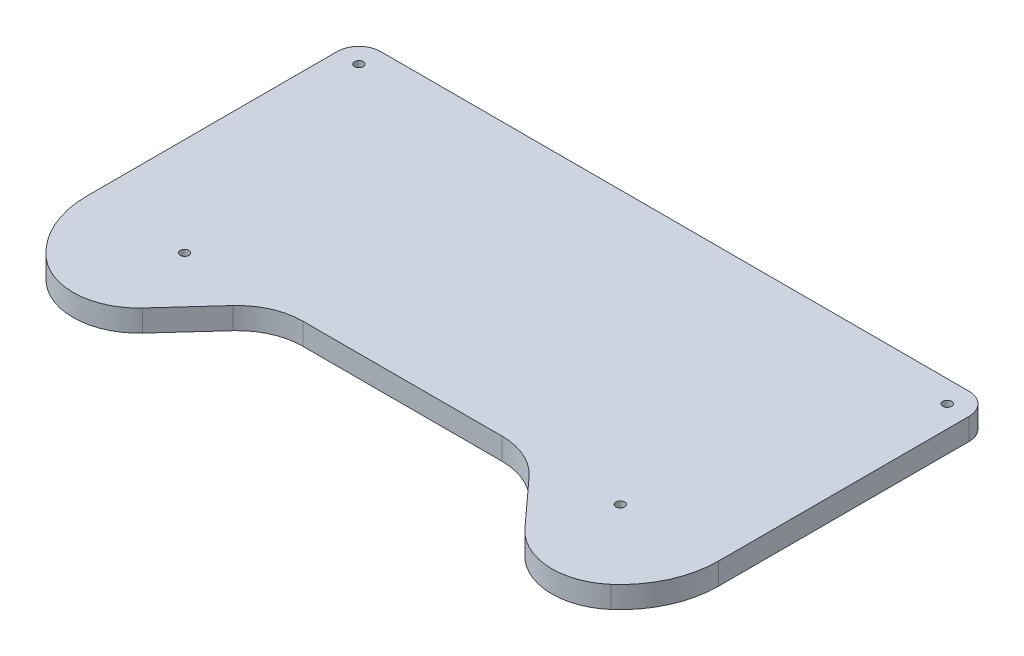
ISO-10303-21;
HEADER;
FILE_DESCRIPTION(('STEP AP214'),'2;1');
FILE_NAME('part.step','',(''),(''),'','','');
FILE_SCHEMA(('AUTOMOTIVE_DESIGN { 1 0 10303 214 1 1 1 1 }'));
ENDSEC;
DATA;
#1=APPLICATION_CONTEXT('core data for automotive mechanical design processes');
#2=APPLICATION_PROTOCOL_DEFINITION('international standard','automotive_design',2000,#1);
#3=PRODUCT_CONTEXT('',#1,'mechanical');
#4=PRODUCT('Part','Part','',(#3));
#5=PRODUCT_RELATED_PRODUCT_CATEGORY('part','',(#4));
#6=PRODUCT_DEFINITION_FORMATION('','',#4);
#7=PRODUCT_DEFINITION_CONTEXT('part definition',#1,'design');
#8=PRODUCT_DEFINITION('design','',#6,#7);
#9=PRODUCT_DEFINITION_SHAPE('','',#8);
#10=(LENGTH_UNIT() NAMED_UNIT(*) SI_UNIT(.MILLI.,.METRE.));
#11=(NAMED_UNIT(*) PLANE_ANGLE_UNIT() SI_UNIT($,.RADIAN.));
#12=(NAMED_UNIT(*) SI_UNIT($,.STERADIAN.) SOLID_ANGLE_UNIT());
#13=UNCERTAINTY_MEASURE_WITH_UNIT(LENGTH_MEASURE(1.E-05),#10,'distance_accuracy_value','');
#14=(GEOMETRIC_REPRESENTATION_CONTEXT(3) GLOBAL_UNCERTAINTY_ASSIGNED_CONTEXT((#13)) GLOBAL_UNIT_ASSIGNED_CONTEXT((#10,
#11,#12)) REPRESENTATION_CONTEXT('',''));
#15=CARTESIAN_POINT('',(0.,0.,0.));
#16=DIRECTION('',(0.,0.,1.));
#17=DIRECTION('',(1.,0.,0.));
#18=AXIS2_PLACEMENT_3D('',#15,#16,#17);
#19=CARTESIAN_POINT('',(9.9999999999999,10.,-165.));
#20=DIRECTION('',(0.,-1.,0.));
#21=DIRECTION('',(0.,0.,-1.));
#22=AXIS2_PLACEMENT_3D('',#19,#20,#21);
#23=CYLINDRICAL_SURFACE('',#22,2.00000000000001);
#24=CARTESIAN_POINT('',(9.9999999999999,10.,-165.));
#25=DIRECTION('',(0.,-1.,0.));
#26=DIRECTION('',(0.,0.,-1.));
#27=AXIS2_PLACEMENT_3D('',#24,#25,#26);
#28=CIRCLE('',#27,2.00000000000001);
#29=CARTESIAN_POINT('',(9.9999999999999,10.,-167.));
#30=VERTEX_POINT('',#29);
#31=EDGE_CURVE('E284',#30,#30,#28,.T.);
#32=ORIENTED_EDGE('',*,*,#31,.F.);
#33=EDGE_LOOP('',(#32));
#34=FACE_BOUND('',#33,.T.);
#35=CARTESIAN_POINT('',(9.9999999999999,5.,-165.));
#36=DIRECTION('',(0.,-1.,0.));
#37=DIRECTION('',(0.,0.,-1.));
#38=AXIS2_PLACEMENT_3D('',#35,#36,#37);
#39=CIRCLE('',#38,2.00000000000001);
#40=CARTESIAN_POINT('',(9.9999999999999,5.,-167.));
#41=VERTEX_POINT('',#40);
#42=EDGE_CURVE('E37',#41,#41,#39,.F.);
#43=ORIENTED_EDGE('',*,*,#42,.F.);
#44=EDGE_LOOP('',(#43));
#45=FACE_BOUND('',#44,.T.);
#46=ADVANCED_FACE('F33',(#34,#45),#23,.F.);
#47=CARTESIAN_POINT('',(280.,10.,-165.));
#48=DIRECTION('',(0.,-1.,0.));
#49=DIRECTION('',(0.,0.,-1.));
#50=AXIS2_PLACEMENT_3D('',#47,#48,#49);
#51=CYLINDRICAL_SURFACE('',#50,2.);
#52=CARTESIAN_POINT('',(280.,10.,-165.));
#53=DIRECTION('',(0.,-1.,0.));
#54=DIRECTION('',(0.,0.,-1.));
#55=AXIS2_PLACEMENT_3D('',#52,#53,#54);
#56=CIRCLE('',#55,2.);
#57=CARTESIAN_POINT('',(280.,10.,-167.));
#58=VERTEX_POINT('',#57);
#59=EDGE_CURVE('E276',#58,#58,#56,.T.);
#60=ORIENTED_EDGE('',*,*,#59,.F.);
#61=EDGE_LOOP('',(#60));
#62=FACE_BOUND('',#61,.T.);
#63=CARTESIAN_POINT('',(280.,5.,-165.));
#64=DIRECTION('',(0.,-1.,0.));
#65=DIRECTION('',(0.,0.,-1.));
#66=AXIS2_PLACEMENT_3D('',#63,#64,#65);
#67=CIRCLE('',#66,2.);
#68=CARTESIAN_POINT('',(280.,5.,-167.));
#69=VERTEX_POINT('',#68);
#70=EDGE_CURVE('E214',#69,#69,#67,.F.);
#71=ORIENTED_EDGE('',*,*,#70,.F.);
#72=EDGE_LOOP('',(#71));
#73=FACE_BOUND('',#72,.T.);
#74=ADVANCED_FACE('F322',(#62,#73),#51,.F.);
#75=CARTESIAN_POINT('',(245.,0.,-50.));
#76=DIRECTION('',(0.,1.,0.));
#77=DIRECTION('',(0.,0.,1.));
#78=AXIS2_PLACEMENT_3D('',#75,#76,#77);
#79=CYLINDRICAL_SURFACE('',#78,2.00000000000002);
#80=CARTESIAN_POINT('',(245.,10.,-50.));
#81=DIRECTION('',(0.,1.,0.));
#82=DIRECTION('',(0.,0.,-1.));
#83=AXIS2_PLACEMENT_3D('',#80,#81,#82);
#84=CIRCLE('',#83,2.00000000000002);
#85=CARTESIAN_POINT('',(245.,10.,-52.));
#86=VERTEX_POINT('',#85);
#87=EDGE_CURVE('E166',#86,#86,#84,.T.);
#88=ORIENTED_EDGE('',*,*,#87,.T.);
#89=EDGE_LOOP('',(#88));
#90=FACE_BOUND('',#89,.T.);
#91=CARTESIAN_POINT('',(245.,5.,-50.));
#92=DIRECTION('',(0.,-1.,0.));
#93=DIRECTION('',(0.,0.,-1.));
#94=AXIS2_PLACEMENT_3D('',#91,#92,#93);
#95=CIRCLE('',#94,2.00000000000002);
#96=CARTESIAN_POINT('',(245.,5.,-52.));
#97=VERTEX_POINT('',#96);
#98=EDGE_CURVE('E210',#97,#97,#95,.F.);
#99=ORIENTED_EDGE('',*,*,#98,.F.);
#100=EDGE_LOOP('',(#99));
#101=FACE_BOUND('',#100,.T.);
#102=ADVANCED_FACE('F328',(#90,#101),#79,.F.);
#103=CARTESIAN_POINT('',(45.,0.,-50.));
#104=DIRECTION('',(0.,1.,0.));
#105=DIRECTION('',(0.,0.,1.));
#106=AXIS2_PLACEMENT_3D('',#103,#104,#105);
#107=CYLINDRICAL_SURFACE('',#106,2.);
#108=CARTESIAN_POINT('',(45.,10.,-50.));
#109=DIRECTION('',(0.,1.,0.));
#110=DIRECTION('',(0.,0.,1.));
#111=AXIS2_PLACEMENT_3D('',#108,#109,#110);
#112=CIRCLE('',#111,2.);
#113=CARTESIAN_POINT('',(45.,10.,-48.));
#114=VERTEX_POINT('',#113);
#115=EDGE_CURVE('E161',#114,#114,#112,.T.);
#116=ORIENTED_EDGE('',*,*,#115,.T.);
#117=EDGE_LOOP('',(#116));
#118=FACE_BOUND('',#117,.T.);
#119=CARTESIAN_POINT('',(45.,5.,-50.));
#120=DIRECTION('',(0.,-1.,0.));
#121=DIRECTION('',(0.,0.,-1.));
#122=AXIS2_PLACEMENT_3D('',#119,#120,#121);
#123=CIRCLE('',#122,2.);
#124=CARTESIAN_POINT('',(45.,5.,-52.));
#125=VERTEX_POINT('',#124);
#126=EDGE_CURVE('E205',#125,#125,#123,.F.);
#127=ORIENTED_EDGE('',*,*,#126,.F.);
#128=EDGE_LOOP('',(#127));
#129=FACE_BOUND('',#128,.T.);
#130=ADVANCED_FACE('F336',(#118,#129),#107,.F.);
#131=CARTESIAN_POINT('',(0.,10.,0.));
#132=DIRECTION('',(0.,-1.,0.));
#133=DIRECTION('',(0.,0.,-1.));
#134=AXIS2_PLACEMENT_3D('',#131,#132,#133);
#135=PLANE('',#134);
#136=ORIENTED_EDGE('',*,*,#59,.T.);
#137=EDGE_LOOP('',(#136));
#138=FACE_BOUND('',#137,.T.);
#139=ORIENTED_EDGE('',*,*,#31,.T.);
#140=EDGE_LOOP('',(#139));
#141=FACE_BOUND('',#140,.T.);
#142=ORIENTED_EDGE('',*,*,#87,.F.);
#143=EDGE_LOOP('',(#142));
#144=FACE_BOUND('',#143,.T.);
#145=ORIENTED_EDGE('',*,*,#115,.F.);
#146=EDGE_LOOP('',(#145));
#147=FACE_BOUND('',#146,.T.);
#148=DIRECTION('',(-0.673718097085599,0.,-0.738988447581801));
#149=VECTOR('',#148,1.);
#150=CARTESIAN_POINT('',(245.,10.,-5.00000000000004));
#151=LINE('',#150,#149);
#152=CARTESIAN_POINT('',(232.699364936198,10.,-18.4923304708477));
#153=VERTEX_POINT('',#152);
#154=CARTESIAN_POINT('',(212.89847829945,10.,-40.211542912568));
#155=VERTEX_POINT('',#154);
#156=EDGE_CURVE('E208',#153,#155,#151,.T.);
#157=ORIENTED_EDGE('',*,*,#156,.F.);
#158=CARTESIAN_POINT('',(254.869018363652,10.,-38.7038733834157));
#159=DIRECTION('',(0.,-1.,0.));
#160=DIRECTION('',(0.,0.,-1.));
#161=AXIS2_PLACEMENT_3D('',#158,#159,#160);
#162=CIRCLE('',#161,30.);
#163=CARTESIAN_POINT('',(274.607055090955,10.,-16.111620150247));
#164=VERTEX_POINT('',#163);
#165=EDGE_CURVE('E197',#153,#164,#162,.F.);
#166=ORIENTED_EDGE('',*,*,#165,.T.);
#167=CARTESIAN_POINT('',(245.,10.,-50.));
#168=DIRECTION('',(0.,1.,0.));
#169=DIRECTION('',(0.,0.,1.));
#170=AXIS2_PLACEMENT_3D('',#167,#168,#169);
#171=CIRCLE('',#170,45.);
#172=CARTESIAN_POINT('',(290.,10.,-50.));
#173=VERTEX_POINT('',#172);
#174=EDGE_CURVE('E155',#164,#173,#171,.T.);
#175=ORIENTED_EDGE('',*,*,#174,.T.);
#176=DIRECTION('',(0.,0.,-1.));
#177=VECTOR('',#176,1.);
#178=CARTESIAN_POINT('',(290.,10.,0.));
#179=LINE('',#178,#177);
#180=CARTESIAN_POINT('',(290.,10.,-165.));
#181=VERTEX_POINT('',#180);
#182=EDGE_CURVE('E169',#173,#181,#179,.T.);
#183=ORIENTED_EDGE('',*,*,#182,.T.);
#184=CARTESIAN_POINT('',(280.,10.,-165.));
#185=DIRECTION('',(0.,1.,0.));
#186=DIRECTION('',(0.,0.,1.));
#187=AXIS2_PLACEMENT_3D('',#184,#185,#186);
#188=CIRCLE('',#187,9.99999999999991);
#189=CARTESIAN_POINT('',(280.,10.,-175.));
#190=VERTEX_POINT('',#189);
#191=EDGE_CURVE('E256',#181,#190,#188,.T.);
#192=ORIENTED_EDGE('',*,*,#191,.T.);
#193=DIRECTION('',(1.,0.,0.));
#194=VECTOR('',#193,1.);
#195=CARTESIAN_POINT('',(0.,10.,-175.));
#196=LINE('',#195,#194);
#197=CARTESIAN_POINT('',(9.9999999999999,10.,-175.));
#198=VERTEX_POINT('',#197);
#199=EDGE_CURVE('E261',#198,#190,#196,.T.);
#200=ORIENTED_EDGE('',*,*,#199,.F.);
#201=CARTESIAN_POINT('',(9.9999999999999,10.,-165.));
#202=DIRECTION('',(0.,1.,0.));
#203=DIRECTION('',(0.,0.,1.));
#204=AXIS2_PLACEMENT_3D('',#201,#202,#203);
#205=CIRCLE('',#204,9.9999999999999);
#206=CARTESIAN_POINT('',(0.,10.,-165.));
#207=VERTEX_POINT('',#206);
#208=EDGE_CURVE('E269',#198,#207,#205,.T.);
#209=ORIENTED_EDGE('',*,*,#208,.T.);
#210=DIRECTION('',(0.,0.,1.));
#211=VECTOR('',#210,1.);
#212=CARTESIAN_POINT('',(0.,10.,0.));
#213=LINE('',#212,#211);
#214=CARTESIAN_POINT('',(0.,10.,-50.));
#215=VERTEX_POINT('',#214);
#216=EDGE_CURVE('E163',#207,#215,#213,.T.);
#217=ORIENTED_EDGE('',*,*,#216,.T.);
#218=CARTESIAN_POINT('',(45.,10.,-50.));
#219=DIRECTION('',(0.,1.,0.));
#220=DIRECTION('',(0.,0.,1.));
#221=AXIS2_PLACEMENT_3D('',#218,#219,#220);
#222=CIRCLE('',#221,45.);
#223=CARTESIAN_POINT('',(15.3929449090449,10.,-16.1116201502469));
#224=VERTEX_POINT('',#223);
#225=EDGE_CURVE('E142',#215,#224,#222,.T.);
#226=ORIENTED_EDGE('',*,*,#225,.T.);
#227=CARTESIAN_POINT('',(35.1309816363483,10.,-38.7038733834156));
#228=DIRECTION('',(0.,-1.,0.));
#229=DIRECTION('',(0.,0.,-1.));
#230=AXIS2_PLACEMENT_3D('',#227,#228,#229);
#231=CIRCLE('',#230,30.);
#232=CARTESIAN_POINT('',(57.3006350638023,10.,-18.4923304708477));
#233=VERTEX_POINT('',#232);
#234=EDGE_CURVE('E195',#224,#233,#231,.F.);
#235=ORIENTED_EDGE('',*,*,#234,.T.);
#236=DIRECTION('',(-0.673718097085598,0.,0.738988447581801));
#237=VECTOR('',#236,1.);
#238=CARTESIAN_POINT('',(86.0254239671264,10.,-50.));
#239=LINE('',#238,#237);
#240=CARTESIAN_POINT('',(77.1015217005503,10.,-40.211542912568));
#241=VERTEX_POINT('',#240);
#242=EDGE_CURVE('E242',#241,#233,#239,.T.);
#243=ORIENTED_EDGE('',*,*,#242,.F.);
#244=CARTESIAN_POINT('',(99.2711751280043,10.,-20.));
#245=DIRECTION('',(0.,-1.,0.));
#246=DIRECTION('',(0.,0.,-1.));
#247=AXIS2_PLACEMENT_3D('',#244,#245,#246);
#248=CIRCLE('',#247,30.);
#249=CARTESIAN_POINT('',(99.2711751280043,10.,-50.));
#250=VERTEX_POINT('',#249);
#251=EDGE_CURVE('E188',#241,#250,#248,.T.);
#252=ORIENTED_EDGE('',*,*,#251,.T.);
#253=DIRECTION('',(-1.,0.,0.));
#254=VECTOR('',#253,1.);
#255=CARTESIAN_POINT('',(203.974576032874,10.,-50.));
#256=LINE('',#255,#254);
#257=CARTESIAN_POINT('',(190.728824871996,10.,-50.));
#258=VERTEX_POINT('',#257);
#259=EDGE_CURVE('E248',#258,#250,#256,.T.);
#260=ORIENTED_EDGE('',*,*,#259,.F.);
#261=CARTESIAN_POINT('',(190.728824871996,10.,-20.));
#262=DIRECTION('',(0.,-1.,0.));
#263=DIRECTION('',(0.,0.,-1.));
#264=AXIS2_PLACEMENT_3D('',#261,#262,#263);
#265=CIRCLE('',#264,30.);
#266=EDGE_CURVE('E183',#258,#155,#265,.T.);
#267=ORIENTED_EDGE('',*,*,#266,.T.);
#268=EDGE_LOOP('',(#157,#166,#175,#183,#192,#200,#209,#217,#226,#235,#243,#252,#260,#267));
#269=FACE_BOUND('',#268,.T.);
#270=ADVANCED_FACE('F292',(#138,#141,#144,#147,#269),#135,.F.);
#271=CARTESIAN_POINT('',(0.,0.,0.));
#272=DIRECTION('',(0.,-1.,0.));
#273=DIRECTION('',(0.,0.,-1.));
#274=AXIS2_PLACEMENT_3D('',#271,#272,#273);
#275=PLANE('',#274);
#276=CARTESIAN_POINT('',(9.9999999999999,0.,-165.));
#277=DIRECTION('',(0.,-1.,0.));
#278=DIRECTION('',(0.,0.,-1.));
#279=AXIS2_PLACEMENT_3D('',#276,#277,#278);
#280=CIRCLE('',#279,6.);
#281=CARTESIAN_POINT('',(9.9999999999999,0.,-171.));
#282=VERTEX_POINT('',#281);
#283=EDGE_CURVE('E230',#282,#282,#280,.T.);
#284=ORIENTED_EDGE('',*,*,#283,.F.);
#285=EDGE_LOOP('',(#284));
#286=FACE_BOUND('',#285,.T.);
#287=CARTESIAN_POINT('',(280.,0.,-165.));
#288=DIRECTION('',(0.,-1.,0.));
#289=DIRECTION('',(0.,0.,-1.));
#290=AXIS2_PLACEMENT_3D('',#287,#288,#289);
#291=CIRCLE('',#290,5.99999999999999);
#292=CARTESIAN_POINT('',(280.,0.,-171.));
#293=VERTEX_POINT('',#292);
#294=EDGE_CURVE('E223',#293,#293,#291,.T.);
#295=ORIENTED_EDGE('',*,*,#294,.F.);
#296=EDGE_LOOP('',(#295));
#297=FACE_BOUND('',#296,.T.);
#298=CARTESIAN_POINT('',(245.,0.,-50.));
#299=DIRECTION('',(0.,-1.,0.));
#300=DIRECTION('',(0.,0.,-1.));
#301=AXIS2_PLACEMENT_3D('',#298,#299,#300);
#302=CIRCLE('',#301,5.99999999999999);
#303=CARTESIAN_POINT('',(245.,0.,-56.));
#304=VERTEX_POINT('',#303);
#305=EDGE_CURVE('E216',#304,#304,#302,.T.);
#306=ORIENTED_EDGE('',*,*,#305,.F.);
#307=EDGE_LOOP('',(#306));
#308=FACE_BOUND('',#307,.T.);
#309=CARTESIAN_POINT('',(45.,0.,-50.));
#310=DIRECTION('',(0.,-1.,0.));
#311=DIRECTION('',(0.,0.,-1.));
#312=AXIS2_PLACEMENT_3D('',#309,#310,#311);
#313=CIRCLE('',#312,6.);
#314=CARTESIAN_POINT('',(45.,0.,-56.));
#315=VERTEX_POINT('',#314);
#316=EDGE_CURVE('E212',#315,#315,#313,.T.);
#317=ORIENTED_EDGE('',*,*,#316,.F.);
#318=EDGE_LOOP('',(#317));
#319=FACE_BOUND('',#318,.T.);
#320=CARTESIAN_POINT('',(245.,0.,-50.));
#321=DIRECTION('',(0.,1.,0.));
#322=DIRECTION('',(0.,0.,1.));
#323=AXIS2_PLACEMENT_3D('',#320,#321,#322);
#324=CIRCLE('',#323,45.);
#325=CARTESIAN_POINT('',(274.607055090955,0.,-16.111620150247));
#326=VERTEX_POINT('',#325);
#327=CARTESIAN_POINT('',(290.,0.,-50.));
#328=VERTEX_POINT('',#327);
#329=EDGE_CURVE('E148',#326,#328,#324,.T.);
#330=ORIENTED_EDGE('',*,*,#329,.F.);
#331=CARTESIAN_POINT('',(254.869018363652,0.,-38.7038733834157));
#332=DIRECTION('',(0.,-1.,0.));
#333=DIRECTION('',(0.,0.,-1.));
#334=AXIS2_PLACEMENT_3D('',#331,#332,#333);
#335=CIRCLE('',#334,30.);
#336=CARTESIAN_POINT('',(232.699364936198,0.,-18.4923304708477));
#337=VERTEX_POINT('',#336);
#338=EDGE_CURVE('E202',#326,#337,#335,.T.);
#339=ORIENTED_EDGE('',*,*,#338,.T.);
#340=DIRECTION('',(-0.673718097085599,0.,-0.738988447581801));
#341=VECTOR('',#340,1.);
#342=CARTESIAN_POINT('',(245.,0.,-5.00000000000004));
#343=LINE('',#342,#341);
#344=CARTESIAN_POINT('',(212.89847829945,0.,-40.211542912568));
#345=VERTEX_POINT('',#344);
#346=EDGE_CURVE('E239',#337,#345,#343,.T.);
#347=ORIENTED_EDGE('',*,*,#346,.T.);
#348=CARTESIAN_POINT('',(190.728824871996,0.,-20.));
#349=DIRECTION('',(0.,-1.,0.));
#350=DIRECTION('',(0.,0.,-1.));
#351=AXIS2_PLACEMENT_3D('',#348,#349,#350);
#352=CIRCLE('',#351,30.);
#353=CARTESIAN_POINT('',(190.728824871996,0.,-50.));
#354=VERTEX_POINT('',#353);
#355=EDGE_CURVE('E186',#345,#354,#352,.F.);
#356=ORIENTED_EDGE('',*,*,#355,.T.);
#357=DIRECTION('',(-1.,0.,0.));
#358=VECTOR('',#357,1.);
#359=CARTESIAN_POINT('',(203.974576032874,0.,-50.));
#360=LINE('',#359,#358);
#361=CARTESIAN_POINT('',(99.2711751280043,0.,-50.));
#362=VERTEX_POINT('',#361);
#363=EDGE_CURVE('E241',#354,#362,#360,.T.);
#364=ORIENTED_EDGE('',*,*,#363,.T.);
#365=CARTESIAN_POINT('',(99.2711751280043,0.,-20.));
#366=DIRECTION('',(0.,-1.,0.));
#367=DIRECTION('',(0.,0.,-1.));
#368=AXIS2_PLACEMENT_3D('',#365,#366,#367);
#369=CIRCLE('',#368,30.);
#370=CARTESIAN_POINT('',(77.1015217005503,0.,-40.211542912568));
#371=VERTEX_POINT('',#370);
#372=EDGE_CURVE('E190',#362,#371,#369,.F.);
#373=ORIENTED_EDGE('',*,*,#372,.T.);
#374=DIRECTION('',(-0.673718097085598,0.,0.738988447581801));
#375=VECTOR('',#374,1.);
#376=CARTESIAN_POINT('',(86.0254239671264,0.,-50.));
#377=LINE('',#376,#375);
#378=CARTESIAN_POINT('',(57.3006350638023,0.,-18.4923304708477));
#379=VERTEX_POINT('',#378);
#380=EDGE_CURVE('E245',#371,#379,#377,.T.);
#381=ORIENTED_EDGE('',*,*,#380,.T.);
#382=CARTESIAN_POINT('',(35.1309816363483,0.,-38.7038733834156));
#383=DIRECTION('',(0.,-1.,0.));
#384=DIRECTION('',(0.,0.,-1.));
#385=AXIS2_PLACEMENT_3D('',#382,#383,#384);
#386=CIRCLE('',#385,30.);
#387=CARTESIAN_POINT('',(15.3929449090449,0.,-16.1116201502469));
#388=VERTEX_POINT('',#387);
#389=EDGE_CURVE('E50',#379,#388,#386,.T.);
#390=ORIENTED_EDGE('',*,*,#389,.T.);
#391=CARTESIAN_POINT('',(45.,0.,-50.));
#392=DIRECTION('',(0.,1.,0.));
#393=DIRECTION('',(0.,0.,1.));
#394=AXIS2_PLACEMENT_3D('',#391,#392,#393);
#395=CIRCLE('',#394,45.);
#396=CARTESIAN_POINT('',(0.,0.,-50.));
#397=VERTEX_POINT('',#396);
#398=EDGE_CURVE('E139',#397,#388,#395,.T.);
#399=ORIENTED_EDGE('',*,*,#398,.F.);
#400=DIRECTION('',(0.,0.,1.));
#401=VECTOR('',#400,1.);
#402=CARTESIAN_POINT('',(0.,0.,0.));
#403=LINE('',#402,#401);
#404=CARTESIAN_POINT('',(0.,0.,-165.));
#405=VERTEX_POINT('',#404);
#406=EDGE_CURVE('E154',#405,#397,#403,.T.);
#407=ORIENTED_EDGE('',*,*,#406,.F.);
#408=CARTESIAN_POINT('',(9.9999999999999,0.,-165.));
#409=DIRECTION('',(0.,1.,0.));
#410=DIRECTION('',(0.,0.,1.));
#411=AXIS2_PLACEMENT_3D('',#408,#409,#410);
#412=CIRCLE('',#411,9.9999999999999);
#413=CARTESIAN_POINT('',(9.9999999999999,0.,-175.));
#414=VERTEX_POINT('',#413);
#415=EDGE_CURVE('E260',#414,#405,#412,.T.);
#416=ORIENTED_EDGE('',*,*,#415,.F.);
#417=DIRECTION('',(1.,0.,0.));
#418=VECTOR('',#417,1.);
#419=CARTESIAN_POINT('',(0.,0.,-175.));
#420=LINE('',#419,#418);
#421=CARTESIAN_POINT('',(280.,0.,-175.));
#422=VERTEX_POINT('',#421);
#423=EDGE_CURVE('E263',#414,#422,#420,.T.);
#424=ORIENTED_EDGE('',*,*,#423,.T.);
#425=CARTESIAN_POINT('',(280.,0.,-165.));
#426=DIRECTION('',(0.,1.,0.));
#427=DIRECTION('',(0.,0.,1.));
#428=AXIS2_PLACEMENT_3D('',#425,#426,#427);
#429=CIRCLE('',#428,9.99999999999991);
#430=CARTESIAN_POINT('',(290.,0.,-165.));
#431=VERTEX_POINT('',#430);
#432=EDGE_CURVE('E258',#431,#422,#429,.T.);
#433=ORIENTED_EDGE('',*,*,#432,.F.);
#434=DIRECTION('',(0.,0.,-1.));
#435=VECTOR('',#434,1.);
#436=CARTESIAN_POINT('',(290.,0.,0.));
#437=LINE('',#436,#435);
#438=EDGE_CURVE('E160',#328,#431,#437,.T.);
#439=ORIENTED_EDGE('',*,*,#438,.F.);
#440=EDGE_LOOP('',(#330,#339,#347,#356,#364,#373,#381,#390,#399,#407,#416,#424,#433,#439));
#441=FACE_BOUND('',#440,.T.);
#442=ADVANCED_FACE('F152',(#286,#297,#308,#319,#441),#275,.T.);
#443=CARTESIAN_POINT('',(290.,10.,0.));
#444=DIRECTION('',(-1.,0.,0.));
#445=DIRECTION('',(0.,0.,1.));
#446=AXIS2_PLACEMENT_3D('',#443,#444,#445);
#447=PLANE('',#446);
#448=DIRECTION('',(0.,1.,0.));
#449=VECTOR('',#448,1.);
#450=CARTESIAN_POINT('',(290.,0.,-50.));
#451=LINE('',#450,#449);
#452=EDGE_CURVE('E147',#328,#173,#451,.T.);
#453=ORIENTED_EDGE('',*,*,#452,.F.);
#454=ORIENTED_EDGE('',*,*,#438,.T.);
#455=DIRECTION('',(0.,1.,0.));
#456=VECTOR('',#455,1.);
#457=CARTESIAN_POINT('',(290.,0.,-165.));
#458=LINE('',#457,#456);
#459=EDGE_CURVE('E266',#431,#181,#458,.T.);
#460=ORIENTED_EDGE('',*,*,#459,.T.);
#461=ORIENTED_EDGE('',*,*,#182,.F.);
#462=EDGE_LOOP('',(#453,#454,#460,#461));
#463=FACE_BOUND('',#462,.T.);
#464=ADVANCED_FACE('F302',(#463),#447,.F.);
#465=CARTESIAN_POINT('',(0.,10.,0.));
#466=DIRECTION('',(1.,0.,0.));
#467=DIRECTION('',(0.,0.,-1.));
#468=AXIS2_PLACEMENT_3D('',#465,#466,#467);
#469=PLANE('',#468);
#470=ORIENTED_EDGE('',*,*,#406,.T.);
#471=DIRECTION('',(0.,1.,0.));
#472=VECTOR('',#471,1.);
#473=CARTESIAN_POINT('',(0.,0.,-50.));
#474=LINE('',#473,#472);
#475=EDGE_CURVE('E136',#397,#215,#474,.T.);
#476=ORIENTED_EDGE('',*,*,#475,.T.);
#477=ORIENTED_EDGE('',*,*,#216,.F.);
#478=DIRECTION('',(0.,1.,0.));
#479=VECTOR('',#478,1.);
#480=CARTESIAN_POINT('',(0.,0.,-165.));
#481=LINE('',#480,#479);
#482=EDGE_CURVE('E159',#405,#207,#481,.T.);
#483=ORIENTED_EDGE('',*,*,#482,.F.);
#484=EDGE_LOOP('',(#470,#476,#477,#483));
#485=FACE_BOUND('',#484,.T.);
#486=ADVANCED_FACE('F158',(#485),#469,.F.);
#487=CARTESIAN_POINT('',(280.,0.,-165.));
#488=DIRECTION('',(0.,1.,0.));
#489=DIRECTION('',(0.,0.,1.));
#490=AXIS2_PLACEMENT_3D('',#487,#488,#489);
#491=CYLINDRICAL_SURFACE('',#490,9.99999999999991);
#492=ORIENTED_EDGE('',*,*,#191,.F.);
#493=ORIENTED_EDGE('',*,*,#459,.F.);
#494=ORIENTED_EDGE('',*,*,#432,.T.);
#495=DIRECTION('',(0.,1.,0.));
#496=VECTOR('',#495,1.);
#497=CARTESIAN_POINT('',(280.,0.,-175.));
#498=LINE('',#497,#496);
#499=EDGE_CURVE('E274',#422,#190,#498,.T.);
#500=ORIENTED_EDGE('',*,*,#499,.T.);
#501=EDGE_LOOP('',(#492,#493,#494,#500));
#502=FACE_BOUND('',#501,.T.);
#503=ADVANCED_FACE('F299',(#502),#491,.T.);
#504=CARTESIAN_POINT('',(0.,0.,-175.));
#505=DIRECTION('',(0.,0.,1.));
#506=DIRECTION('',(1.,0.,0.));
#507=AXIS2_PLACEMENT_3D('',#504,#505,#506);
#508=PLANE('',#507);
#509=ORIENTED_EDGE('',*,*,#199,.T.);
#510=ORIENTED_EDGE('',*,*,#499,.F.);
#511=ORIENTED_EDGE('',*,*,#423,.F.);
#512=DIRECTION('',(0.,1.,0.));
#513=VECTOR('',#512,1.);
#514=CARTESIAN_POINT('',(9.9999999999999,0.,-175.));
#515=LINE('',#514,#513);
#516=EDGE_CURVE('E277',#414,#198,#515,.T.);
#517=ORIENTED_EDGE('',*,*,#516,.T.);
#518=EDGE_LOOP('',(#509,#510,#511,#517));
#519=FACE_BOUND('',#518,.T.);
#520=ADVANCED_FACE('F306',(#519),#508,.F.);
#521=CARTESIAN_POINT('',(9.9999999999999,0.,-165.));
#522=DIRECTION('',(0.,1.,0.));
#523=DIRECTION('',(0.,0.,1.));
#524=AXIS2_PLACEMENT_3D('',#521,#522,#523);
#525=CYLINDRICAL_SURFACE('',#524,9.9999999999999);
#526=ORIENTED_EDGE('',*,*,#208,.F.);
#527=ORIENTED_EDGE('',*,*,#516,.F.);
#528=ORIENTED_EDGE('',*,*,#415,.T.);
#529=ORIENTED_EDGE('',*,*,#482,.T.);
#530=EDGE_LOOP('',(#526,#527,#528,#529));
#531=FACE_BOUND('',#530,.T.);
#532=ADVANCED_FACE('F310',(#531),#525,.T.);
#533=CARTESIAN_POINT('',(45.,0.,-50.));
#534=DIRECTION('',(0.,1.,0.));
#535=DIRECTION('',(0.,0.,1.));
#536=AXIS2_PLACEMENT_3D('',#533,#534,#535);
#537=CYLINDRICAL_SURFACE('',#536,45.);
#538=ORIENTED_EDGE('',*,*,#398,.T.);
#539=DIRECTION('',(0.,1.,0.));
#540=VECTOR('',#539,1.);
#541=CARTESIAN_POINT('',(15.3929449090449,0.,-16.1116201502469));
#542=LINE('',#541,#540);
#543=EDGE_CURVE('E42',#388,#224,#542,.T.);
#544=ORIENTED_EDGE('',*,*,#543,.T.);
#545=ORIENTED_EDGE('',*,*,#225,.F.);
#546=ORIENTED_EDGE('',*,*,#475,.F.);
#547=EDGE_LOOP('',(#538,#544,#545,#546));
#548=FACE_BOUND('',#547,.T.);
#549=ADVANCED_FACE('F137',(#548),#537,.T.);
#550=CARTESIAN_POINT('',(245.,0.,-50.));
#551=DIRECTION('',(0.,1.,0.));
#552=DIRECTION('',(0.,0.,1.));
#553=AXIS2_PLACEMENT_3D('',#550,#551,#552);
#554=CYLINDRICAL_SURFACE('',#553,45.);
#555=ORIENTED_EDGE('',*,*,#174,.F.);
#556=DIRECTION('',(0.,1.,0.));
#557=VECTOR('',#556,1.);
#558=CARTESIAN_POINT('',(274.607055090955,0.,-16.1116201502471));
#559=LINE('',#558,#557);
#560=EDGE_CURVE('E199',#164,#326,#559,.F.);
#561=ORIENTED_EDGE('',*,*,#560,.T.);
#562=ORIENTED_EDGE('',*,*,#329,.T.);
#563=ORIENTED_EDGE('',*,*,#452,.T.);
#564=EDGE_LOOP('',(#555,#561,#562,#563));
#565=FACE_BOUND('',#564,.T.);
#566=ADVANCED_FACE('F317',(#565),#554,.T.);
#567=CARTESIAN_POINT('',(86.0254239671264,0.,-50.));
#568=DIRECTION('',(-0.738988447581801,0.,-0.673718097085598));
#569=DIRECTION('',(-0.673718097085598,0.,0.738988447581801));
#570=AXIS2_PLACEMENT_3D('',#567,#568,#569);
#571=PLANE('',#570);
#572=ORIENTED_EDGE('',*,*,#242,.T.);
#573=DIRECTION('',(0.,-1.,0.));
#574=VECTOR('',#573,1.);
#575=CARTESIAN_POINT('',(57.3006350638023,0.,-18.4923304708477));
#576=LINE('',#575,#574);
#577=EDGE_CURVE('E11',#233,#379,#576,.T.);
#578=ORIENTED_EDGE('',*,*,#577,.T.);
#579=ORIENTED_EDGE('',*,*,#380,.F.);
#580=DIRECTION('',(0.,1.,0.));
#581=VECTOR('',#580,1.);
#582=CARTESIAN_POINT('',(77.1015217005503,10.,-40.211542912568));
#583=LINE('',#582,#581);
#584=EDGE_CURVE('E180',#371,#241,#583,.T.);
#585=ORIENTED_EDGE('',*,*,#584,.T.);
#586=EDGE_LOOP('',(#572,#578,#579,#585));
#587=FACE_BOUND('',#586,.T.);
#588=ADVANCED_FACE('F381',(#587),#571,.F.);
#589=CARTESIAN_POINT('',(203.974576032874,0.,-50.));
#590=DIRECTION('',(0.,0.,-1.));
#591=DIRECTION('',(-1.,0.,0.));
#592=AXIS2_PLACEMENT_3D('',#589,#590,#591);
#593=PLANE('',#592);
#594=ORIENTED_EDGE('',*,*,#363,.F.);
#595=DIRECTION('',(0.,1.,0.));
#596=VECTOR('',#595,1.);
#597=CARTESIAN_POINT('',(190.728824871996,10.,-50.));
#598=LINE('',#597,#596);
#599=EDGE_CURVE('E174',#354,#258,#598,.T.);
#600=ORIENTED_EDGE('',*,*,#599,.T.);
#601=ORIENTED_EDGE('',*,*,#259,.T.);
#602=DIRECTION('',(0.,1.,0.));
#603=VECTOR('',#602,1.);
#604=CARTESIAN_POINT('',(99.2711751280043,0.,-50.));
#605=LINE('',#604,#603);
#606=EDGE_CURVE('E172',#250,#362,#605,.F.);
#607=ORIENTED_EDGE('',*,*,#606,.T.);
#608=EDGE_LOOP('',(#594,#600,#601,#607));
#609=FACE_BOUND('',#608,.T.);
#610=ADVANCED_FACE('F377',(#609),#593,.F.);
#611=CARTESIAN_POINT('',(245.,0.,-5.00000000000004));
#612=DIRECTION('',(0.738988447581801,0.,-0.673718097085599));
#613=DIRECTION('',(-0.673718097085599,0.,-0.738988447581801));
#614=AXIS2_PLACEMENT_3D('',#611,#612,#613);
#615=PLANE('',#614);
#616=ORIENTED_EDGE('',*,*,#346,.F.);
#617=DIRECTION('',(0.,-1.,0.));
#618=VECTOR('',#617,1.);
#619=CARTESIAN_POINT('',(232.699364936198,10.,-18.4923304708477));
#620=LINE('',#619,#618);
#621=EDGE_CURVE('E192',#337,#153,#620,.F.);
#622=ORIENTED_EDGE('',*,*,#621,.T.);
#623=ORIENTED_EDGE('',*,*,#156,.T.);
#624=DIRECTION('',(0.,1.,0.));
#625=VECTOR('',#624,1.);
#626=CARTESIAN_POINT('',(212.89847829945,0.,-40.211542912568));
#627=LINE('',#626,#625);
#628=EDGE_CURVE('E177',#155,#345,#627,.F.);
#629=ORIENTED_EDGE('',*,*,#628,.T.);
#630=EDGE_LOOP('',(#616,#622,#623,#629));
#631=FACE_BOUND('',#630,.T.);
#632=ADVANCED_FACE('F355',(#631),#615,.F.);
#633=CARTESIAN_POINT('',(190.728824871996,0.,-20.));
#634=DIRECTION('',(0.,-1.,0.));
#635=DIRECTION('',(0.,0.,-1.));
#636=AXIS2_PLACEMENT_3D('',#633,#634,#635);
#637=CYLINDRICAL_SURFACE('',#636,30.);
#638=ORIENTED_EDGE('',*,*,#355,.F.);
#639=ORIENTED_EDGE('',*,*,#628,.F.);
#640=ORIENTED_EDGE('',*,*,#266,.F.);
#641=ORIENTED_EDGE('',*,*,#599,.F.);
#642=EDGE_LOOP('',(#638,#639,#640,#641));
#643=FACE_BOUND('',#642,.T.);
#644=ADVANCED_FACE('F351',(#643),#637,.F.);
#645=CARTESIAN_POINT('',(99.2711751280043,0.,-20.));
#646=DIRECTION('',(0.,-1.,0.));
#647=DIRECTION('',(0.,0.,-1.));
#648=AXIS2_PLACEMENT_3D('',#645,#646,#647);
#649=CYLINDRICAL_SURFACE('',#648,30.);
#650=ORIENTED_EDGE('',*,*,#372,.F.);
#651=ORIENTED_EDGE('',*,*,#606,.F.);
#652=ORIENTED_EDGE('',*,*,#251,.F.);
#653=ORIENTED_EDGE('',*,*,#584,.F.);
#654=EDGE_LOOP('',(#650,#651,#652,#653));
#655=FACE_BOUND('',#654,.T.);
#656=ADVANCED_FACE('F354',(#655),#649,.F.);
#657=CARTESIAN_POINT('',(254.869018363652,0.,-38.7038733834157));
#658=DIRECTION('',(0.,1.,0.));
#659=DIRECTION('',(0.,0.,1.));
#660=AXIS2_PLACEMENT_3D('',#657,#658,#659);
#661=CYLINDRICAL_SURFACE('',#660,30.);
#662=ORIENTED_EDGE('',*,*,#338,.F.);
#663=ORIENTED_EDGE('',*,*,#560,.F.);
#664=ORIENTED_EDGE('',*,*,#165,.F.);
#665=ORIENTED_EDGE('',*,*,#621,.F.);
#666=EDGE_LOOP('',(#662,#663,#664,#665));
#667=FACE_BOUND('',#666,.T.);
#668=ADVANCED_FACE('F358',(#667),#661,.T.);
#669=CARTESIAN_POINT('',(35.1309816363483,0.,-38.7038733834156));
#670=DIRECTION('',(0.,1.,0.));
#671=DIRECTION('',(0.,0.,1.));
#672=AXIS2_PLACEMENT_3D('',#669,#670,#671);
#673=CYLINDRICAL_SURFACE('',#672,30.);
#674=ORIENTED_EDGE('',*,*,#389,.F.);
#675=ORIENTED_EDGE('',*,*,#577,.F.);
#676=ORIENTED_EDGE('',*,*,#234,.F.);
#677=ORIENTED_EDGE('',*,*,#543,.F.);
#678=EDGE_LOOP('',(#674,#675,#676,#677));
#679=FACE_BOUND('',#678,.T.);
#680=ADVANCED_FACE('F35',(#679),#673,.T.);
#681=CARTESIAN_POINT('',(45.,5.,-50.));
#682=DIRECTION('',(0.,-1.,0.));
#683=DIRECTION('',(0.,0.,-1.));
#684=AXIS2_PLACEMENT_3D('',#681,#682,#683);
#685=PLANE('',#684);
#686=CARTESIAN_POINT('',(45.,5.,-50.));
#687=DIRECTION('',(0.,-1.,0.));
#688=DIRECTION('',(0.,0.,-1.));
#689=AXIS2_PLACEMENT_3D('',#686,#687,#688);
#690=CIRCLE('',#689,6.);
#691=CARTESIAN_POINT('',(45.,5.,-56.));
#692=VERTEX_POINT('',#691);
#693=EDGE_CURVE('E209',#692,#692,#690,.T.);
#694=ORIENTED_EDGE('',*,*,#693,.T.);
#695=EDGE_LOOP('',(#694));
#696=FACE_BOUND('',#695,.T.);
#697=ORIENTED_EDGE('',*,*,#126,.T.);
#698=EDGE_LOOP('',(#697));
#699=FACE_BOUND('',#698,.T.);
#700=ADVANCED_FACE('F365',(#696,#699),#685,.T.);
#701=CARTESIAN_POINT('',(45.,5.,-50.));
#702=DIRECTION('',(0.,-1.,0.));
#703=DIRECTION('',(0.,0.,-1.));
#704=AXIS2_PLACEMENT_3D('',#701,#702,#703);
#705=CYLINDRICAL_SURFACE('',#704,6.);
#706=ORIENTED_EDGE('',*,*,#693,.F.);
#707=EDGE_LOOP('',(#706));
#708=FACE_BOUND('',#707,.T.);
#709=ORIENTED_EDGE('',*,*,#316,.T.);
#710=EDGE_LOOP('',(#709));
#711=FACE_BOUND('',#710,.T.);
#712=ADVANCED_FACE('F395',(#708,#711),#705,.F.);
#713=CARTESIAN_POINT('',(245.,5.,-50.));
#714=DIRECTION('',(0.,-1.,0.));
#715=DIRECTION('',(0.,0.,-1.));
#716=AXIS2_PLACEMENT_3D('',#713,#714,#715);
#717=PLANE('',#716);
#718=CARTESIAN_POINT('',(245.,5.,-50.));
#719=DIRECTION('',(0.,-1.,0.));
#720=DIRECTION('',(0.,0.,-1.));
#721=AXIS2_PLACEMENT_3D('',#718,#719,#720);
#722=CIRCLE('',#721,5.99999999999999);
#723=CARTESIAN_POINT('',(245.,5.,-56.));
#724=VERTEX_POINT('',#723);
#725=EDGE_CURVE('E213',#724,#724,#722,.T.);
#726=ORIENTED_EDGE('',*,*,#725,.T.);
#727=EDGE_LOOP('',(#726));
#728=FACE_BOUND('',#727,.T.);
#729=ORIENTED_EDGE('',*,*,#98,.T.);
#730=EDGE_LOOP('',(#729));
#731=FACE_BOUND('',#730,.T.);
#732=ADVANCED_FACE('F398',(#728,#731),#717,.T.);
#733=CARTESIAN_POINT('',(245.,5.,-50.));
#734=DIRECTION('',(0.,-1.,0.));
#735=DIRECTION('',(0.,0.,-1.));
#736=AXIS2_PLACEMENT_3D('',#733,#734,#735);
#737=CYLINDRICAL_SURFACE('',#736,5.99999999999999);
#738=ORIENTED_EDGE('',*,*,#725,.F.);
#739=EDGE_LOOP('',(#738));
#740=FACE_BOUND('',#739,.T.);
#741=ORIENTED_EDGE('',*,*,#305,.T.);
#742=EDGE_LOOP('',(#741));
#743=FACE_BOUND('',#742,.T.);
#744=ADVANCED_FACE('F403',(#740,#743),#737,.F.);
#745=CARTESIAN_POINT('',(280.,5.,-165.));
#746=DIRECTION('',(0.,-1.,0.));
#747=DIRECTION('',(0.,0.,-1.));
#748=AXIS2_PLACEMENT_3D('',#745,#746,#747);
#749=PLANE('',#748);
#750=CARTESIAN_POINT('',(280.,5.,-165.));
#751=DIRECTION('',(0.,-1.,0.));
#752=DIRECTION('',(0.,0.,-1.));
#753=AXIS2_PLACEMENT_3D('',#750,#751,#752);
#754=CIRCLE('',#753,5.99999999999999);
#755=CARTESIAN_POINT('',(280.,5.,-171.));
#756=VERTEX_POINT('',#755);
#757=EDGE_CURVE('E217',#756,#756,#754,.T.);
#758=ORIENTED_EDGE('',*,*,#757,.T.);
#759=EDGE_LOOP('',(#758));
#760=FACE_BOUND('',#759,.T.);
#761=ORIENTED_EDGE('',*,*,#70,.T.);
#762=EDGE_LOOP('',(#761));
#763=FACE_BOUND('',#762,.T.);
#764=ADVANCED_FACE('F406',(#760,#763),#749,.T.);
#765=CARTESIAN_POINT('',(280.,5.,-165.));
#766=DIRECTION('',(0.,-1.,0.));
#767=DIRECTION('',(0.,0.,-1.));
#768=AXIS2_PLACEMENT_3D('',#765,#766,#767);
#769=CYLINDRICAL_SURFACE('',#768,5.99999999999999);
#770=ORIENTED_EDGE('',*,*,#757,.F.);
#771=EDGE_LOOP('',(#770));
#772=FACE_BOUND('',#771,.T.);
#773=ORIENTED_EDGE('',*,*,#294,.T.);
#774=EDGE_LOOP('',(#773));
#775=FACE_BOUND('',#774,.T.);
#776=ADVANCED_FACE('F411',(#772,#775),#769,.F.);
#777=CARTESIAN_POINT('',(9.9999999999999,5.,-165.));
#778=DIRECTION('',(0.,-1.,0.));
#779=DIRECTION('',(0.,0.,-1.));
#780=AXIS2_PLACEMENT_3D('',#777,#778,#779);
#781=PLANE('',#780);
#782=CARTESIAN_POINT('',(9.9999999999999,5.,-165.));
#783=DIRECTION('',(0.,-1.,0.));
#784=DIRECTION('',(0.,0.,-1.));
#785=AXIS2_PLACEMENT_3D('',#782,#783,#784);
#786=CIRCLE('',#785,6.);
#787=CARTESIAN_POINT('',(9.9999999999999,5.,-171.));
#788=VERTEX_POINT('',#787);
#789=EDGE_CURVE('E429',#788,#788,#786,.T.);
#790=ORIENTED_EDGE('',*,*,#789,.T.);
#791=EDGE_LOOP('',(#790));
#792=FACE_BOUND('',#791,.T.);
#793=ORIENTED_EDGE('',*,*,#42,.T.);
#794=EDGE_LOOP('',(#793));
#795=FACE_BOUND('',#794,.T.);
#796=ADVANCED_FACE('F414',(#792,#795),#781,.T.);
#797=CARTESIAN_POINT('',(9.9999999999999,5.,-165.));
#798=DIRECTION('',(0.,-1.,0.));
#799=DIRECTION('',(0.,0.,-1.));
#800=AXIS2_PLACEMENT_3D('',#797,#798,#799);
#801=CYLINDRICAL_SURFACE('',#800,6.);
#802=ORIENTED_EDGE('',*,*,#789,.F.);
#803=EDGE_LOOP('',(#802));
#804=FACE_BOUND('',#803,.T.);
#805=ORIENTED_EDGE('',*,*,#283,.T.);
#806=EDGE_LOOP('',(#805));
#807=FACE_BOUND('',#806,.T.);
#808=ADVANCED_FACE('F418',(#804,#807),#801,.F.);
#809=CLOSED_SHELL('',(#46,#74,#102,#130,#270,#442,#464,#486,#503,#520,#532,#549,#566,#588,#610,
#632,#644,#656,#668,#680,#700,#712,#732,#744,#764,#776,#796,#808));
#810=MANIFOLD_SOLID_BREP('B2',#809);
#811=ADVANCED_BREP_SHAPE_REPRESENTATION('',(#18,#810),#14);
#812=SHAPE_DEFINITION_REPRESENTATION(#9,#811);
ENDSEC;
END-ISO-10303-21;
